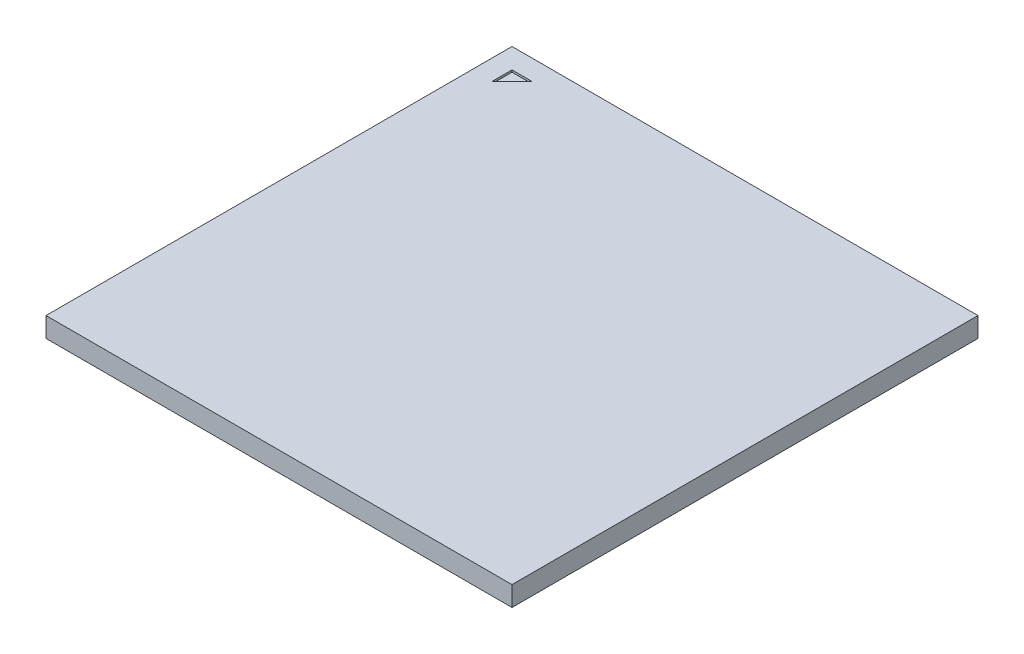
ISO-10303-21;
HEADER;
FILE_DESCRIPTION(('STEP AP214'),'2;1');
FILE_NAME('part.step','',(''),(''),'','','');
FILE_SCHEMA(('AUTOMOTIVE_DESIGN { 1 0 10303 214 1 1 1 1 }'));
ENDSEC;
DATA;
#1=APPLICATION_CONTEXT('core data for automotive mechanical design processes');
#2=APPLICATION_PROTOCOL_DEFINITION('international standard','automotive_design',2000,#1);
#3=PRODUCT_CONTEXT('',#1,'mechanical');
#4=PRODUCT('Part','Part','',(#3));
#5=PRODUCT_RELATED_PRODUCT_CATEGORY('part','',(#4));
#6=PRODUCT_DEFINITION_FORMATION('','',#4);
#7=PRODUCT_DEFINITION_CONTEXT('part definition',#1,'design');
#8=PRODUCT_DEFINITION('design','',#6,#7);
#9=PRODUCT_DEFINITION_SHAPE('','',#8);
#10=(LENGTH_UNIT() NAMED_UNIT(*) SI_UNIT(.MILLI.,.METRE.));
#11=(NAMED_UNIT(*) PLANE_ANGLE_UNIT() SI_UNIT($,.RADIAN.));
#12=(NAMED_UNIT(*) SI_UNIT($,.STERADIAN.) SOLID_ANGLE_UNIT());
#13=UNCERTAINTY_MEASURE_WITH_UNIT(LENGTH_MEASURE(1.E-05),#10,'distance_accuracy_value','');
#14=(GEOMETRIC_REPRESENTATION_CONTEXT(3) GLOBAL_UNCERTAINTY_ASSIGNED_CONTEXT((#13)) GLOBAL_UNIT_ASSIGNED_CONTEXT((#10,
#11,#12)) REPRESENTATION_CONTEXT('',''));
#15=CARTESIAN_POINT('',(0.,0.,0.));
#16=DIRECTION('',(0.,0.,1.));
#17=DIRECTION('',(1.,0.,0.));
#18=AXIS2_PLACEMENT_3D('',#15,#16,#17);
#19=CARTESIAN_POINT('',(11.5,0.98,11.5));
#20=DIRECTION('',(-1.,0.,0.));
#21=DIRECTION('',(0.,0.,1.));
#22=AXIS2_PLACEMENT_3D('',#19,#20,#21);
#23=PLANE('',#22);
#24=DIRECTION('',(0.,0.,-1.));
#25=VECTOR('',#24,1.);
#26=CARTESIAN_POINT('',(11.5,0.,11.5));
#27=LINE('',#26,#25);
#28=CARTESIAN_POINT('',(11.5,0.,11.5));
#29=VERTEX_POINT('',#28);
#30=CARTESIAN_POINT('',(11.5,0.,-11.5));
#31=VERTEX_POINT('',#30);
#32=EDGE_CURVE('E129',#29,#31,#27,.T.);
#33=ORIENTED_EDGE('',*,*,#32,.T.);
#34=DIRECTION('',(0.,-1.,0.));
#35=VECTOR('',#34,1.);
#36=CARTESIAN_POINT('',(11.5,0.98,-11.5));
#37=LINE('',#36,#35);
#38=CARTESIAN_POINT('',(11.5,0.98,-11.5));
#39=VERTEX_POINT('',#38);
#40=EDGE_CURVE('E11',#39,#31,#37,.T.);
#41=ORIENTED_EDGE('',*,*,#40,.F.);
#42=DIRECTION('',(0.,0.,-1.));
#43=VECTOR('',#42,1.);
#44=CARTESIAN_POINT('',(11.5,0.98,11.5));
#45=LINE('',#44,#43);
#46=CARTESIAN_POINT('',(11.5,0.98,11.5));
#47=VERTEX_POINT('',#46);
#48=EDGE_CURVE('E131',#47,#39,#45,.T.);
#49=ORIENTED_EDGE('',*,*,#48,.F.);
#50=DIRECTION('',(0.,-1.,0.));
#51=VECTOR('',#50,1.);
#52=CARTESIAN_POINT('',(11.5,0.98,11.5));
#53=LINE('',#52,#51);
#54=EDGE_CURVE('E137',#47,#29,#53,.T.);
#55=ORIENTED_EDGE('',*,*,#54,.T.);
#56=EDGE_LOOP('',(#33,#41,#49,#55));
#57=FACE_BOUND('',#56,.T.);
#58=ADVANCED_FACE('F34',(#57),#23,.F.);
#59=CARTESIAN_POINT('',(-11.5,0.98,-11.5));
#60=DIRECTION('',(0.,0.,1.));
#61=DIRECTION('',(1.,0.,0.));
#62=AXIS2_PLACEMENT_3D('',#59,#60,#61);
#63=PLANE('',#62);
#64=DIRECTION('',(-1.,0.,0.));
#65=VECTOR('',#64,1.);
#66=CARTESIAN_POINT('',(-11.5,0.,-11.5));
#67=LINE('',#66,#65);
#68=CARTESIAN_POINT('',(-11.5,0.,-11.5));
#69=VERTEX_POINT('',#68);
#70=EDGE_CURVE('E140',#31,#69,#67,.T.);
#71=ORIENTED_EDGE('',*,*,#70,.T.);
#72=DIRECTION('',(0.,-1.,0.));
#73=VECTOR('',#72,1.);
#74=CARTESIAN_POINT('',(-11.5,0.98,-11.5));
#75=LINE('',#74,#73);
#76=CARTESIAN_POINT('',(-11.5,0.98,-11.5));
#77=VERTEX_POINT('',#76);
#78=EDGE_CURVE('E41',#77,#69,#75,.T.);
#79=ORIENTED_EDGE('',*,*,#78,.F.);
#80=DIRECTION('',(-1.,0.,0.));
#81=VECTOR('',#80,1.);
#82=CARTESIAN_POINT('',(-11.5,0.98,-11.5));
#83=LINE('',#82,#81);
#84=EDGE_CURVE('E85',#39,#77,#83,.T.);
#85=ORIENTED_EDGE('',*,*,#84,.F.);
#86=ORIENTED_EDGE('',*,*,#40,.T.);
#87=EDGE_LOOP('',(#71,#79,#85,#86));
#88=FACE_BOUND('',#87,.T.);
#89=ADVANCED_FACE('F169',(#88),#63,.F.);
#90=CARTESIAN_POINT('',(-11.5,0.98,11.5));
#91=DIRECTION('',(1.,0.,0.));
#92=DIRECTION('',(0.,0.,-1.));
#93=AXIS2_PLACEMENT_3D('',#90,#91,#92);
#94=PLANE('',#93);
#95=DIRECTION('',(0.,0.,1.));
#96=VECTOR('',#95,1.);
#97=CARTESIAN_POINT('',(-11.5,0.,11.5));
#98=LINE('',#97,#96);
#99=CARTESIAN_POINT('',(-11.5,0.,11.5));
#100=VERTEX_POINT('',#99);
#101=EDGE_CURVE('E142',#69,#100,#98,.T.);
#102=ORIENTED_EDGE('',*,*,#101,.T.);
#103=DIRECTION('',(0.,-1.,0.));
#104=VECTOR('',#103,1.);
#105=CARTESIAN_POINT('',(-11.5,0.98,11.5));
#106=LINE('',#105,#104);
#107=CARTESIAN_POINT('',(-11.5,0.98,11.5));
#108=VERTEX_POINT('',#107);
#109=EDGE_CURVE('E146',#108,#100,#106,.T.);
#110=ORIENTED_EDGE('',*,*,#109,.F.);
#111=DIRECTION('',(0.,0.,1.));
#112=VECTOR('',#111,1.);
#113=CARTESIAN_POINT('',(-11.5,0.98,11.5));
#114=LINE('',#113,#112);
#115=EDGE_CURVE('E134',#77,#108,#114,.T.);
#116=ORIENTED_EDGE('',*,*,#115,.F.);
#117=ORIENTED_EDGE('',*,*,#78,.T.);
#118=EDGE_LOOP('',(#102,#110,#116,#117));
#119=FACE_BOUND('',#118,.T.);
#120=ADVANCED_FACE('F151',(#119),#94,.F.);
#121=CARTESIAN_POINT('',(-11.5,0.98,11.5));
#122=DIRECTION('',(0.,0.,-1.));
#123=DIRECTION('',(-1.,0.,0.));
#124=AXIS2_PLACEMENT_3D('',#121,#122,#123);
#125=PLANE('',#124);
#126=DIRECTION('',(1.,0.,0.));
#127=VECTOR('',#126,1.);
#128=CARTESIAN_POINT('',(-11.5,0.,11.5));
#129=LINE('',#128,#127);
#130=EDGE_CURVE('E78',#100,#29,#129,.T.);
#131=ORIENTED_EDGE('',*,*,#130,.T.);
#132=ORIENTED_EDGE('',*,*,#54,.F.);
#133=DIRECTION('',(1.,0.,0.));
#134=VECTOR('',#133,1.);
#135=CARTESIAN_POINT('',(-11.5,0.98,11.5));
#136=LINE('',#135,#134);
#137=EDGE_CURVE('E57',#108,#47,#136,.T.);
#138=ORIENTED_EDGE('',*,*,#137,.F.);
#139=ORIENTED_EDGE('',*,*,#109,.T.);
#140=EDGE_LOOP('',(#131,#132,#138,#139));
#141=FACE_BOUND('',#140,.T.);
#142=ADVANCED_FACE('F159',(#141),#125,.F.);
#143=CARTESIAN_POINT('',(0.,0.98,0.));
#144=DIRECTION('',(0.,-1.,0.));
#145=DIRECTION('',(0.,0.,-1.));
#146=AXIS2_PLACEMENT_3D('',#143,#144,#145);
#147=PLANE('',#146);
#148=DIRECTION('',(0.707106781186547,0.,-0.707106781186548));
#149=VECTOR('',#148,1.);
#150=CARTESIAN_POINT('',(-9.5,0.98,-10.5));
#151=LINE('',#150,#149);
#152=CARTESIAN_POINT('',(-10.5,0.98,-9.5));
#153=VERTEX_POINT('',#152);
#154=CARTESIAN_POINT('',(-9.5,0.98,-10.5));
#155=VERTEX_POINT('',#154);
#156=EDGE_CURVE('E121',#153,#155,#151,.T.);
#157=ORIENTED_EDGE('',*,*,#156,.F.);
#158=DIRECTION('',(0.,0.,1.));
#159=VECTOR('',#158,1.);
#160=CARTESIAN_POINT('',(-10.5,0.98,-9.5));
#161=LINE('',#160,#159);
#162=CARTESIAN_POINT('',(-10.5,0.98,-10.5));
#163=VERTEX_POINT('',#162);
#164=EDGE_CURVE('E48',#163,#153,#161,.T.);
#165=ORIENTED_EDGE('',*,*,#164,.F.);
#166=DIRECTION('',(-1.,0.,0.));
#167=VECTOR('',#166,1.);
#168=CARTESIAN_POINT('',(-10.5,0.98,-10.5));
#169=LINE('',#168,#167);
#170=EDGE_CURVE('E118',#155,#163,#169,.T.);
#171=ORIENTED_EDGE('',*,*,#170,.F.);
#172=EDGE_LOOP('',(#157,#165,#171));
#173=FACE_BOUND('',#172,.T.);
#174=ORIENTED_EDGE('',*,*,#48,.T.);
#175=ORIENTED_EDGE('',*,*,#84,.T.);
#176=ORIENTED_EDGE('',*,*,#115,.T.);
#177=ORIENTED_EDGE('',*,*,#137,.T.);
#178=EDGE_LOOP('',(#174,#175,#176,#177));
#179=FACE_BOUND('',#178,.T.);
#180=ADVANCED_FACE('F161',(#173,#179),#147,.F.);
#181=CARTESIAN_POINT('',(0.,0.,0.));
#182=DIRECTION('',(0.,-1.,0.));
#183=DIRECTION('',(0.,0.,-1.));
#184=AXIS2_PLACEMENT_3D('',#181,#182,#183);
#185=PLANE('',#184);
#186=ORIENTED_EDGE('',*,*,#32,.F.);
#187=ORIENTED_EDGE('',*,*,#130,.F.);
#188=ORIENTED_EDGE('',*,*,#101,.F.);
#189=ORIENTED_EDGE('',*,*,#70,.F.);
#190=EDGE_LOOP('',(#186,#187,#188,#189));
#191=FACE_BOUND('',#190,.T.);
#192=ADVANCED_FACE('F155',(#191),#185,.T.);
#193=CARTESIAN_POINT('',(-10.5,0.88,-9.5));
#194=DIRECTION('',(-1.,0.,0.));
#195=DIRECTION('',(0.,0.,1.));
#196=AXIS2_PLACEMENT_3D('',#193,#194,#195);
#197=PLANE('',#196);
#198=ORIENTED_EDGE('',*,*,#164,.T.);
#199=DIRECTION('',(0.,1.,0.));
#200=VECTOR('',#199,1.);
#201=CARTESIAN_POINT('',(-10.5,0.88,-9.5));
#202=LINE('',#201,#200);
#203=CARTESIAN_POINT('',(-10.5,0.88,-9.5));
#204=VERTEX_POINT('',#203);
#205=EDGE_CURVE('E99',#204,#153,#202,.T.);
#206=ORIENTED_EDGE('',*,*,#205,.F.);
#207=DIRECTION('',(0.,0.,1.));
#208=VECTOR('',#207,1.);
#209=CARTESIAN_POINT('',(-10.5,0.88,-9.5));
#210=LINE('',#209,#208);
#211=CARTESIAN_POINT('',(-10.5,0.88,-10.5));
#212=VERTEX_POINT('',#211);
#213=EDGE_CURVE('E103',#212,#204,#210,.T.);
#214=ORIENTED_EDGE('',*,*,#213,.F.);
#215=DIRECTION('',(0.,1.,0.));
#216=VECTOR('',#215,1.);
#217=CARTESIAN_POINT('',(-10.5,0.88,-10.5));
#218=LINE('',#217,#216);
#219=EDGE_CURVE('E127',#212,#163,#218,.T.);
#220=ORIENTED_EDGE('',*,*,#219,.T.);
#221=EDGE_LOOP('',(#198,#206,#214,#220));
#222=FACE_BOUND('',#221,.T.);
#223=ADVANCED_FACE('F101',(#222),#197,.F.);
#224=CARTESIAN_POINT('',(-10.5,0.88,-10.5));
#225=DIRECTION('',(0.,0.,-1.));
#226=DIRECTION('',(-1.,0.,0.));
#227=AXIS2_PLACEMENT_3D('',#224,#225,#226);
#228=PLANE('',#227);
#229=ORIENTED_EDGE('',*,*,#170,.T.);
#230=ORIENTED_EDGE('',*,*,#219,.F.);
#231=DIRECTION('',(-1.,0.,0.));
#232=VECTOR('',#231,1.);
#233=CARTESIAN_POINT('',(-10.5,0.88,-10.5));
#234=LINE('',#233,#232);
#235=CARTESIAN_POINT('',(-9.5,0.88,-10.5));
#236=VERTEX_POINT('',#235);
#237=EDGE_CURVE('E109',#236,#212,#234,.T.);
#238=ORIENTED_EDGE('',*,*,#237,.F.);
#239=DIRECTION('',(0.,1.,0.));
#240=VECTOR('',#239,1.);
#241=CARTESIAN_POINT('',(-9.5,0.88,-10.5));
#242=LINE('',#241,#240);
#243=EDGE_CURVE('E108',#236,#155,#242,.T.);
#244=ORIENTED_EDGE('',*,*,#243,.T.);
#245=EDGE_LOOP('',(#229,#230,#238,#244));
#246=FACE_BOUND('',#245,.T.);
#247=ADVANCED_FACE('F208',(#246),#228,.F.);
#248=CARTESIAN_POINT('',(-9.5,0.88,-10.5));
#249=DIRECTION('',(0.707106781186548,0.,0.707106781186547));
#250=DIRECTION('',(0.707106781186547,0.,-0.707106781186548));
#251=AXIS2_PLACEMENT_3D('',#248,#249,#250);
#252=PLANE('',#251);
#253=ORIENTED_EDGE('',*,*,#156,.T.);
#254=ORIENTED_EDGE('',*,*,#243,.F.);
#255=DIRECTION('',(0.707106781186547,0.,-0.707106781186548));
#256=VECTOR('',#255,1.);
#257=CARTESIAN_POINT('',(-9.5,0.88,-10.5));
#258=LINE('',#257,#256);
#259=EDGE_CURVE('E112',#204,#236,#258,.T.);
#260=ORIENTED_EDGE('',*,*,#259,.F.);
#261=ORIENTED_EDGE('',*,*,#205,.T.);
#262=EDGE_LOOP('',(#253,#254,#260,#261));
#263=FACE_BOUND('',#262,.T.);
#264=ADVANCED_FACE('F113',(#263),#252,.F.);
#265=CARTESIAN_POINT('',(0.,0.88,0.));
#266=DIRECTION('',(0.,-1.,0.));
#267=DIRECTION('',(0.,0.,-1.));
#268=AXIS2_PLACEMENT_3D('',#265,#266,#267);
#269=PLANE('',#268);
#270=ORIENTED_EDGE('',*,*,#213,.T.);
#271=ORIENTED_EDGE('',*,*,#259,.T.);
#272=ORIENTED_EDGE('',*,*,#237,.T.);
#273=EDGE_LOOP('',(#270,#271,#272));
#274=FACE_BOUND('',#273,.T.);
#275=ADVANCED_FACE('F117',(#274),#269,.F.);
#276=CLOSED_SHELL('',(#58,#89,#120,#142,#180,#192,#223,#247,#264,#275));
#277=MANIFOLD_SOLID_BREP('B2',#276);
#278=ADVANCED_BREP_SHAPE_REPRESENTATION('',(#18,#277),#14);
#279=SHAPE_DEFINITION_REPRESENTATION(#9,#278);
ENDSEC;
END-ISO-10303-21;
